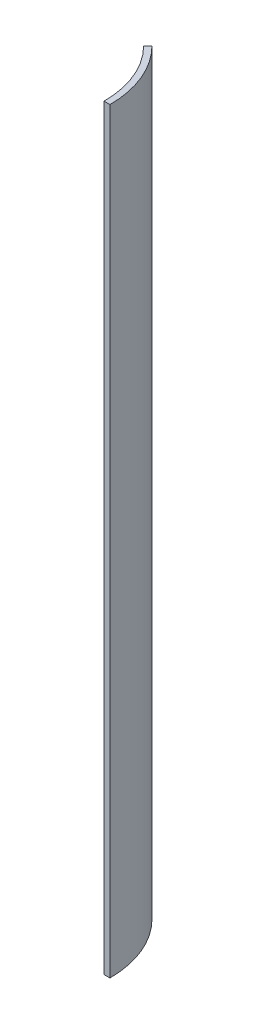
ISO-10303-21;
HEADER;
FILE_DESCRIPTION(('STEP AP214'),'2;1');
FILE_NAME('part.step','',(''),(''),'','','');
FILE_SCHEMA(('AUTOMOTIVE_DESIGN { 1 0 10303 214 1 1 1 1 }'));
ENDSEC;
DATA;
#1=APPLICATION_CONTEXT('core data for automotive mechanical design processes');
#2=APPLICATION_PROTOCOL_DEFINITION('international standard','automotive_design',2000,#1);
#3=PRODUCT_CONTEXT('',#1,'mechanical');
#4=PRODUCT('Part','Part','',(#3));
#5=PRODUCT_RELATED_PRODUCT_CATEGORY('part','',(#4));
#6=PRODUCT_DEFINITION_FORMATION('','',#4);
#7=PRODUCT_DEFINITION_CONTEXT('part definition',#1,'design');
#8=PRODUCT_DEFINITION('design','',#6,#7);
#9=PRODUCT_DEFINITION_SHAPE('','',#8);
#10=(LENGTH_UNIT() NAMED_UNIT(*) SI_UNIT(.MILLI.,.METRE.));
#11=(NAMED_UNIT(*) PLANE_ANGLE_UNIT() SI_UNIT($,.RADIAN.));
#12=(NAMED_UNIT(*) SI_UNIT($,.STERADIAN.) SOLID_ANGLE_UNIT());
#13=UNCERTAINTY_MEASURE_WITH_UNIT(LENGTH_MEASURE(1.E-05),#10,'distance_accuracy_value','');
#14=(GEOMETRIC_REPRESENTATION_CONTEXT(3) GLOBAL_UNCERTAINTY_ASSIGNED_CONTEXT((#13)) GLOBAL_UNIT_ASSIGNED_CONTEXT((#10,
#11,#12)) REPRESENTATION_CONTEXT('',''));
#15=CARTESIAN_POINT('',(0.,0.,0.));
#16=DIRECTION('',(0.,0.,1.));
#17=DIRECTION('',(1.,0.,0.));
#18=AXIS2_PLACEMENT_3D('',#15,#16,#17);
#19=CARTESIAN_POINT('',(0.,819.187021794204,0.));
#20=DIRECTION('',(0.,1.,0.));
#21=DIRECTION('',(0.,0.,1.));
#22=AXIS2_PLACEMENT_3D('',#19,#20,#21);
#23=CYLINDRICAL_SURFACE('',#22,65.7860000000001);
#24=DIRECTION('',(0.,1.,0.));
#25=VECTOR('',#24,1.);
#26=CARTESIAN_POINT('',(46.5177267071388,819.187021794204,-46.5177267071377));
#27=LINE('',#26,#25);
#28=CARTESIAN_POINT('',(46.5177267071388,0.,-46.5177267071376));
#29=VERTEX_POINT('',#28);
#30=CARTESIAN_POINT('',(46.5177267071389,520.7,-46.5177267071377));
#31=VERTEX_POINT('',#30);
#32=EDGE_CURVE('E91',#29,#31,#27,.T.);
#33=ORIENTED_EDGE('',*,*,#32,.F.);
#34=CARTESIAN_POINT('',(0.,0.,0.));
#35=DIRECTION('',(0.,1.,0.));
#36=DIRECTION('',(0.,0.,1.));
#37=AXIS2_PLACEMENT_3D('',#34,#35,#36);
#38=CIRCLE('',#37,65.786);
#39=CARTESIAN_POINT('',(65.786,0.,0.));
#40=VERTEX_POINT('',#39);
#41=EDGE_CURVE('E88',#40,#29,#38,.T.);
#42=ORIENTED_EDGE('',*,*,#41,.F.);
#43=DIRECTION('',(0.,1.,0.));
#44=VECTOR('',#43,1.);
#45=CARTESIAN_POINT('',(65.7860000000001,819.187021794204,0.));
#46=LINE('',#45,#44);
#47=CARTESIAN_POINT('',(65.7860000000001,520.7,0.));
#48=VERTEX_POINT('',#47);
#49=EDGE_CURVE('E54',#40,#48,#46,.T.);
#50=ORIENTED_EDGE('',*,*,#49,.T.);
#51=CARTESIAN_POINT('',(0.,520.7,0.));
#52=DIRECTION('',(0.,1.,0.));
#53=DIRECTION('',(0.,0.,1.));
#54=AXIS2_PLACEMENT_3D('',#51,#52,#53);
#55=CIRCLE('',#54,65.7860000000001);
#56=EDGE_CURVE('E77',#48,#31,#55,.T.);
#57=ORIENTED_EDGE('',*,*,#56,.T.);
#58=EDGE_LOOP('',(#33,#42,#50,#57));
#59=FACE_BOUND('',#58,.T.);
#60=ADVANCED_FACE('F33',(#59),#23,.F.);
#61=CARTESIAN_POINT('',(-65.7860000000001,520.7,0.));
#62=DIRECTION('',(0.,1.,0.));
#63=DIRECTION('',(0.,0.,1.));
#64=AXIS2_PLACEMENT_3D('',#61,#62,#63);
#65=PLANE('',#64);
#66=DIRECTION('',(0.707106781186556,0.,-0.707106781186539));
#67=VECTOR('',#66,1.);
#68=CARTESIAN_POINT('',(-32.8930000000009,520.7,32.8930000000001));
#69=LINE('',#68,#67);
#70=CARTESIAN_POINT('',(49.391408665881,520.7,-49.3914086658798));
#71=VERTEX_POINT('',#70);
#72=EDGE_CURVE('E102',#31,#71,#69,.T.);
#73=ORIENTED_EDGE('',*,*,#72,.F.);
#74=ORIENTED_EDGE('',*,*,#56,.F.);
#75=DIRECTION('',(1.,0.,0.));
#76=VECTOR('',#75,1.);
#77=CARTESIAN_POINT('',(-65.7860000000001,520.7,0.));
#78=LINE('',#77,#76);
#79=CARTESIAN_POINT('',(69.85,520.7,0.));
#80=VERTEX_POINT('',#79);
#81=EDGE_CURVE('E85',#48,#80,#78,.T.);
#82=ORIENTED_EDGE('',*,*,#81,.T.);
#83=CARTESIAN_POINT('',(0.,520.7,0.));
#84=DIRECTION('',(0.,1.,0.));
#85=DIRECTION('',(0.,0.,1.));
#86=AXIS2_PLACEMENT_3D('',#83,#84,#85);
#87=CIRCLE('',#86,69.85);
#88=EDGE_CURVE('E84',#80,#71,#87,.T.);
#89=ORIENTED_EDGE('',*,*,#88,.T.);
#90=EDGE_LOOP('',(#73,#74,#82,#89));
#91=FACE_BOUND('',#90,.T.);
#92=ADVANCED_FACE('F101',(#91),#65,.T.);
#93=CARTESIAN_POINT('',(0.,819.187021794204,0.));
#94=DIRECTION('',(0.,1.,0.));
#95=DIRECTION('',(0.,0.,1.));
#96=AXIS2_PLACEMENT_3D('',#93,#94,#95);
#97=CYLINDRICAL_SURFACE('',#96,69.85);
#98=DIRECTION('',(0.,1.,0.));
#99=VECTOR('',#98,1.);
#100=CARTESIAN_POINT('',(49.391408665881,819.187021794204,-49.3914086658798));
#101=LINE('',#100,#99);
#102=CARTESIAN_POINT('',(49.3914086658809,0.,-49.3914086658797));
#103=VERTEX_POINT('',#102);
#104=EDGE_CURVE('E46',#71,#103,#101,.F.);
#105=ORIENTED_EDGE('',*,*,#104,.F.);
#106=ORIENTED_EDGE('',*,*,#88,.F.);
#107=DIRECTION('',(0.,1.,0.));
#108=VECTOR('',#107,1.);
#109=CARTESIAN_POINT('',(69.85,819.187021794204,0.));
#110=LINE('',#109,#108);
#111=CARTESIAN_POINT('',(69.85,0.,0.));
#112=VERTEX_POINT('',#111);
#113=EDGE_CURVE('E71',#80,#112,#110,.F.);
#114=ORIENTED_EDGE('',*,*,#113,.T.);
#115=CARTESIAN_POINT('',(0.,0.,0.));
#116=DIRECTION('',(0.,1.,0.));
#117=DIRECTION('',(0.,0.,1.));
#118=AXIS2_PLACEMENT_3D('',#115,#116,#117);
#119=CIRCLE('',#118,69.85);
#120=EDGE_CURVE('E82',#112,#103,#119,.T.);
#121=ORIENTED_EDGE('',*,*,#120,.T.);
#122=EDGE_LOOP('',(#105,#106,#114,#121));
#123=FACE_BOUND('',#122,.T.);
#124=ADVANCED_FACE('F81',(#123),#97,.T.);
#125=CARTESIAN_POINT('',(-65.786,0.,0.));
#126=DIRECTION('',(0.,-1.,0.));
#127=DIRECTION('',(0.,0.,-1.));
#128=AXIS2_PLACEMENT_3D('',#125,#126,#127);
#129=PLANE('',#128);
#130=DIRECTION('',(-0.707106781186556,0.,0.707106781186539));
#131=VECTOR('',#130,1.);
#132=CARTESIAN_POINT('',(-32.8930000000008,0.,32.893));
#133=LINE('',#132,#131);
#134=EDGE_CURVE('E11',#103,#29,#133,.T.);
#135=ORIENTED_EDGE('',*,*,#134,.F.);
#136=ORIENTED_EDGE('',*,*,#120,.F.);
#137=DIRECTION('',(-1.,0.,0.));
#138=VECTOR('',#137,1.);
#139=CARTESIAN_POINT('',(-65.786,0.,0.));
#140=LINE('',#139,#138);
#141=EDGE_CURVE('E40',#112,#40,#140,.T.);
#142=ORIENTED_EDGE('',*,*,#141,.T.);
#143=ORIENTED_EDGE('',*,*,#41,.T.);
#144=EDGE_LOOP('',(#135,#136,#142,#143));
#145=FACE_BOUND('',#144,.T.);
#146=ADVANCED_FACE('F87',(#145),#129,.T.);
#147=CARTESIAN_POINT('',(0.,0.,0.));
#148=DIRECTION('',(0.,0.,1.));
#149=DIRECTION('',(1.,0.,0.));
#150=AXIS2_PLACEMENT_3D('',#147,#148,#149);
#151=PLANE('',#150);
#152=ORIENTED_EDGE('',*,*,#141,.F.);
#153=ORIENTED_EDGE('',*,*,#113,.F.);
#154=ORIENTED_EDGE('',*,*,#81,.F.);
#155=ORIENTED_EDGE('',*,*,#49,.F.);
#156=EDGE_LOOP('',(#152,#153,#154,#155));
#157=FACE_BOUND('',#156,.T.);
#158=ADVANCED_FACE('F70',(#157),#151,.T.);
#159=CARTESIAN_POINT('',(0.,0.,0.));
#160=DIRECTION('',(0.707106781186539,0.,0.707106781186556));
#161=DIRECTION('',(0.707106781186556,0.,-0.707106781186539));
#162=AXIS2_PLACEMENT_3D('',#159,#160,#161);
#163=PLANE('',#162);
#164=ORIENTED_EDGE('',*,*,#32,.T.);
#165=ORIENTED_EDGE('',*,*,#72,.T.);
#166=ORIENTED_EDGE('',*,*,#104,.T.);
#167=ORIENTED_EDGE('',*,*,#134,.T.);
#168=EDGE_LOOP('',(#164,#165,#166,#167));
#169=FACE_BOUND('',#168,.T.);
#170=ADVANCED_FACE('F107',(#169),#163,.F.);
#171=CLOSED_SHELL('',(#60,#92,#124,#146,#158,#170));
#172=MANIFOLD_SOLID_BREP('B2',#171);
#173=ADVANCED_BREP_SHAPE_REPRESENTATION('',(#18,#172),#14);
#174=SHAPE_DEFINITION_REPRESENTATION(#9,#173);
ENDSEC;
END-ISO-10303-21;
